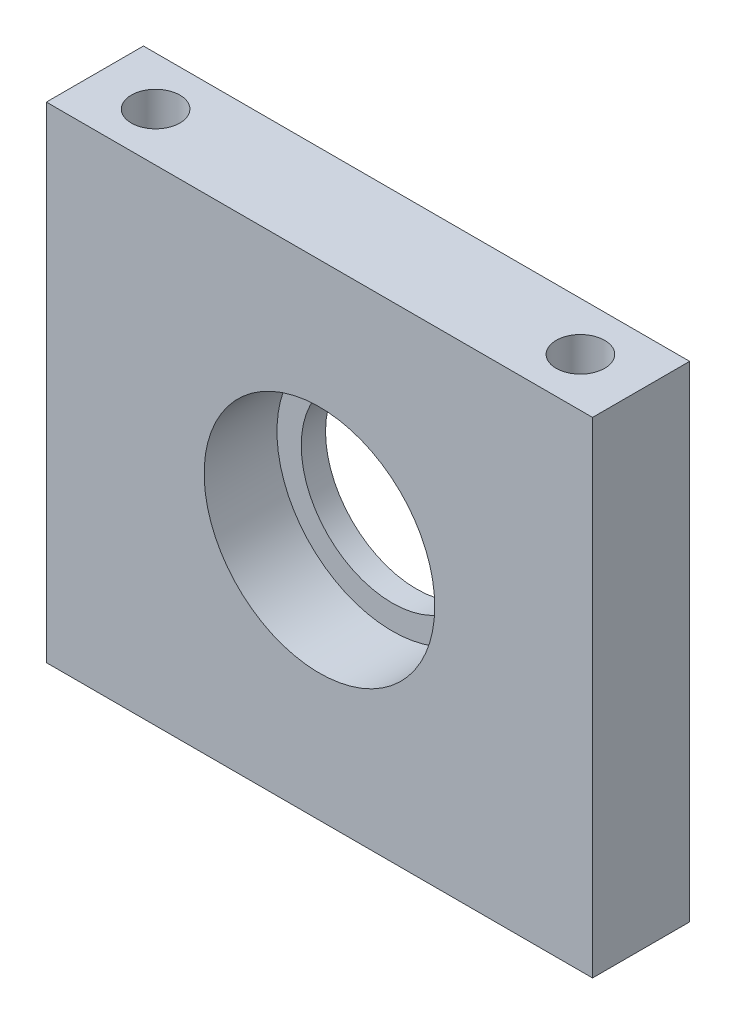
ISO-10303-21;
HEADER;
FILE_DESCRIPTION(('STEP AP214'),'2;1');
FILE_NAME('part.step','',(''),(''),'','','');
FILE_SCHEMA(('AUTOMOTIVE_DESIGN { 1 0 10303 214 1 1 1 1 }'));
ENDSEC;
DATA;
#1=APPLICATION_CONTEXT('core data for automotive mechanical design processes');
#2=APPLICATION_PROTOCOL_DEFINITION('international standard','automotive_design',2000,#1);
#3=PRODUCT_CONTEXT('',#1,'mechanical');
#4=PRODUCT('Part','Part','',(#3));
#5=PRODUCT_RELATED_PRODUCT_CATEGORY('part','',(#4));
#6=PRODUCT_DEFINITION_FORMATION('','',#4);
#7=PRODUCT_DEFINITION_CONTEXT('part definition',#1,'design');
#8=PRODUCT_DEFINITION('design','',#6,#7);
#9=PRODUCT_DEFINITION_SHAPE('','',#8);
#10=(LENGTH_UNIT() NAMED_UNIT(*) SI_UNIT(.MILLI.,.METRE.));
#11=(NAMED_UNIT(*) PLANE_ANGLE_UNIT() SI_UNIT($,.RADIAN.));
#12=(NAMED_UNIT(*) SI_UNIT($,.STERADIAN.) SOLID_ANGLE_UNIT());
#13=UNCERTAINTY_MEASURE_WITH_UNIT(LENGTH_MEASURE(1.E-05),#10,'distance_accuracy_value','');
#14=(GEOMETRIC_REPRESENTATION_CONTEXT(3) GLOBAL_UNCERTAINTY_ASSIGNED_CONTEXT((#13)) GLOBAL_UNIT_ASSIGNED_CONTEXT((#10,
#11,#12)) REPRESENTATION_CONTEXT('',''));
#15=CARTESIAN_POINT('',(0.,0.,0.));
#16=DIRECTION('',(0.,0.,1.));
#17=DIRECTION('',(1.,0.,0.));
#18=AXIS2_PLACEMENT_3D('',#15,#16,#17);
#19=CARTESIAN_POINT('',(0.,0.,0.));
#20=DIRECTION('',(0.,0.,1.));
#21=DIRECTION('',(1.,0.,0.));
#22=AXIS2_PLACEMENT_3D('',#19,#20,#21);
#23=CYLINDRICAL_SURFACE('',#22,7.5);
#24=CARTESIAN_POINT('',(0.,0.,0.));
#25=DIRECTION('',(0.,0.,1.));
#26=DIRECTION('',(1.,0.,0.));
#27=AXIS2_PLACEMENT_3D('',#24,#25,#26);
#28=CIRCLE('',#27,7.5);
#29=CARTESIAN_POINT('',(7.5,0.,0.));
#30=VERTEX_POINT('',#29);
#31=EDGE_CURVE('E101',#30,#30,#28,.T.);
#32=ORIENTED_EDGE('',*,*,#31,.F.);
#33=EDGE_LOOP('',(#32));
#34=FACE_BOUND('',#33,.T.);
#35=CARTESIAN_POINT('',(0.,0.,2.));
#36=DIRECTION('',(0.,0.,1.));
#37=DIRECTION('',(1.,0.,0.));
#38=AXIS2_PLACEMENT_3D('',#35,#36,#37);
#39=CIRCLE('',#38,7.5);
#40=CARTESIAN_POINT('',(7.5,0.,2.));
#41=VERTEX_POINT('',#40);
#42=EDGE_CURVE('E36',#41,#41,#39,.F.);
#43=ORIENTED_EDGE('',*,*,#42,.F.);
#44=EDGE_LOOP('',(#43));
#45=FACE_BOUND('',#44,.T.);
#46=ADVANCED_FACE('F32',(#34,#45),#23,.F.);
#47=CARTESIAN_POINT('',(22.5,-20.,8.));
#48=DIRECTION('',(-1.,0.,0.));
#49=DIRECTION('',(0.,0.,1.));
#50=AXIS2_PLACEMENT_3D('',#47,#48,#49);
#51=PLANE('',#50);
#52=DIRECTION('',(0.,1.,0.));
#53=VECTOR('',#52,1.);
#54=CARTESIAN_POINT('',(22.5,-20.,0.));
#55=LINE('',#54,#53);
#56=CARTESIAN_POINT('',(22.5,-20.,0.));
#57=VERTEX_POINT('',#56);
#58=CARTESIAN_POINT('',(22.5,20.,0.));
#59=VERTEX_POINT('',#58);
#60=EDGE_CURVE('E98',#57,#59,#55,.T.);
#61=ORIENTED_EDGE('',*,*,#60,.T.);
#62=DIRECTION('',(0.,0.,-1.));
#63=VECTOR('',#62,1.);
#64=CARTESIAN_POINT('',(22.5,20.,8.));
#65=LINE('',#64,#63);
#66=CARTESIAN_POINT('',(22.5,20.,8.));
#67=VERTEX_POINT('',#66);
#68=EDGE_CURVE('E11',#67,#59,#65,.T.);
#69=ORIENTED_EDGE('',*,*,#68,.F.);
#70=DIRECTION('',(0.,1.,0.));
#71=VECTOR('',#70,1.);
#72=CARTESIAN_POINT('',(22.5,-20.,8.));
#73=LINE('',#72,#71);
#74=CARTESIAN_POINT('',(22.5,-20.,8.));
#75=VERTEX_POINT('',#74);
#76=EDGE_CURVE('E85',#75,#67,#73,.T.);
#77=ORIENTED_EDGE('',*,*,#76,.F.);
#78=DIRECTION('',(0.,0.,-1.));
#79=VECTOR('',#78,1.);
#80=CARTESIAN_POINT('',(22.5,-20.,8.));
#81=LINE('',#80,#79);
#82=EDGE_CURVE('E94',#75,#57,#81,.T.);
#83=ORIENTED_EDGE('',*,*,#82,.T.);
#84=EDGE_LOOP('',(#61,#69,#77,#83));
#85=FACE_BOUND('',#84,.T.);
#86=ADVANCED_FACE('F34',(#85),#51,.F.);
#87=CARTESIAN_POINT('',(-22.5,20.,8.));
#88=DIRECTION('',(0.,-1.,0.));
#89=DIRECTION('',(0.,0.,-1.));
#90=AXIS2_PLACEMENT_3D('',#87,#88,#89);
#91=PLANE('',#90);
#92=CARTESIAN_POINT('',(-17.5,20.,4.));
#93=DIRECTION('',(0.,1.,0.));
#94=DIRECTION('',(0.,0.,1.));
#95=AXIS2_PLACEMENT_3D('',#92,#93,#94);
#96=CIRCLE('',#95,2.);
#97=CARTESIAN_POINT('',(-17.5,20.,6.));
#98=VERTEX_POINT('',#97);
#99=EDGE_CURVE('E127',#98,#98,#96,.T.);
#100=ORIENTED_EDGE('',*,*,#99,.F.);
#101=EDGE_LOOP('',(#100));
#102=FACE_BOUND('',#101,.T.);
#103=CARTESIAN_POINT('',(17.5,20.,4.));
#104=DIRECTION('',(0.,1.,0.));
#105=DIRECTION('',(0.,0.,1.));
#106=AXIS2_PLACEMENT_3D('',#103,#104,#105);
#107=CIRCLE('',#106,2.);
#108=CARTESIAN_POINT('',(17.5,20.,6.));
#109=VERTEX_POINT('',#108);
#110=EDGE_CURVE('E121',#109,#109,#107,.T.);
#111=ORIENTED_EDGE('',*,*,#110,.F.);
#112=EDGE_LOOP('',(#111));
#113=FACE_BOUND('',#112,.T.);
#114=DIRECTION('',(-1.,0.,0.));
#115=VECTOR('',#114,1.);
#116=CARTESIAN_POINT('',(-22.5,20.,0.));
#117=LINE('',#116,#115);
#118=CARTESIAN_POINT('',(-22.5,20.,0.));
#119=VERTEX_POINT('',#118);
#120=EDGE_CURVE('E89',#59,#119,#117,.T.);
#121=ORIENTED_EDGE('',*,*,#120,.T.);
#122=DIRECTION('',(0.,0.,-1.));
#123=VECTOR('',#122,1.);
#124=CARTESIAN_POINT('',(-22.5,20.,8.));
#125=LINE('',#124,#123);
#126=CARTESIAN_POINT('',(-22.5,20.,8.));
#127=VERTEX_POINT('',#126);
#128=EDGE_CURVE('E42',#127,#119,#125,.T.);
#129=ORIENTED_EDGE('',*,*,#128,.F.);
#130=DIRECTION('',(-1.,0.,0.));
#131=VECTOR('',#130,1.);
#132=CARTESIAN_POINT('',(-22.5,20.,8.));
#133=LINE('',#132,#131);
#134=EDGE_CURVE('E80',#67,#127,#133,.T.);
#135=ORIENTED_EDGE('',*,*,#134,.F.);
#136=ORIENTED_EDGE('',*,*,#68,.T.);
#137=EDGE_LOOP('',(#121,#129,#135,#136));
#138=FACE_BOUND('',#137,.T.);
#139=ADVANCED_FACE('F88',(#102,#113,#138),#91,.F.);
#140=CARTESIAN_POINT('',(-22.5,-20.,8.));
#141=DIRECTION('',(1.,0.,0.));
#142=DIRECTION('',(0.,0.,-1.));
#143=AXIS2_PLACEMENT_3D('',#140,#141,#142);
#144=PLANE('',#143);
#145=DIRECTION('',(0.,-1.,0.));
#146=VECTOR('',#145,1.);
#147=CARTESIAN_POINT('',(-22.5,-20.,0.));
#148=LINE('',#147,#146);
#149=CARTESIAN_POINT('',(-22.5,-20.,0.));
#150=VERTEX_POINT('',#149);
#151=EDGE_CURVE('E67',#119,#150,#148,.T.);
#152=ORIENTED_EDGE('',*,*,#151,.T.);
#153=DIRECTION('',(0.,0.,-1.));
#154=VECTOR('',#153,1.);
#155=CARTESIAN_POINT('',(-22.5,-20.,8.));
#156=LINE('',#155,#154);
#157=CARTESIAN_POINT('',(-22.5,-20.,8.));
#158=VERTEX_POINT('',#157);
#159=EDGE_CURVE('E90',#158,#150,#156,.T.);
#160=ORIENTED_EDGE('',*,*,#159,.F.);
#161=DIRECTION('',(0.,-1.,0.));
#162=VECTOR('',#161,1.);
#163=CARTESIAN_POINT('',(-22.5,-20.,8.));
#164=LINE('',#163,#162);
#165=EDGE_CURVE('E83',#127,#158,#164,.T.);
#166=ORIENTED_EDGE('',*,*,#165,.F.);
#167=ORIENTED_EDGE('',*,*,#128,.T.);
#168=EDGE_LOOP('',(#152,#160,#166,#167));
#169=FACE_BOUND('',#168,.T.);
#170=ADVANCED_FACE('F92',(#169),#144,.F.);
#171=CARTESIAN_POINT('',(-22.5,-20.,8.));
#172=DIRECTION('',(0.,1.,0.));
#173=DIRECTION('',(0.,0.,1.));
#174=AXIS2_PLACEMENT_3D('',#171,#172,#173);
#175=PLANE('',#174);
#176=CARTESIAN_POINT('',(-17.5,-20.,4.));
#177=DIRECTION('',(0.,1.,0.));
#178=DIRECTION('',(0.,0.,1.));
#179=AXIS2_PLACEMENT_3D('',#176,#177,#178);
#180=CIRCLE('',#179,2.);
#181=CARTESIAN_POINT('',(-17.5,-20.,6.));
#182=VERTEX_POINT('',#181);
#183=EDGE_CURVE('E118',#182,#182,#180,.T.);
#184=ORIENTED_EDGE('',*,*,#183,.T.);
#185=EDGE_LOOP('',(#184));
#186=FACE_BOUND('',#185,.T.);
#187=CARTESIAN_POINT('',(17.5,-20.,4.));
#188=DIRECTION('',(0.,1.,0.));
#189=DIRECTION('',(0.,0.,1.));
#190=AXIS2_PLACEMENT_3D('',#187,#188,#189);
#191=CIRCLE('',#190,2.);
#192=CARTESIAN_POINT('',(17.5,-20.,6.));
#193=VERTEX_POINT('',#192);
#194=EDGE_CURVE('E124',#193,#193,#191,.T.);
#195=ORIENTED_EDGE('',*,*,#194,.T.);
#196=EDGE_LOOP('',(#195));
#197=FACE_BOUND('',#196,.T.);
#198=DIRECTION('',(1.,0.,0.));
#199=VECTOR('',#198,1.);
#200=CARTESIAN_POINT('',(-22.5,-20.,0.));
#201=LINE('',#200,#199);
#202=EDGE_CURVE('E73',#150,#57,#201,.T.);
#203=ORIENTED_EDGE('',*,*,#202,.T.);
#204=ORIENTED_EDGE('',*,*,#82,.F.);
#205=DIRECTION('',(1.,0.,0.));
#206=VECTOR('',#205,1.);
#207=CARTESIAN_POINT('',(-22.5,-20.,8.));
#208=LINE('',#207,#206);
#209=EDGE_CURVE('E50',#158,#75,#208,.T.);
#210=ORIENTED_EDGE('',*,*,#209,.F.);
#211=ORIENTED_EDGE('',*,*,#159,.T.);
#212=EDGE_LOOP('',(#203,#204,#210,#211));
#213=FACE_BOUND('',#212,.T.);
#214=ADVANCED_FACE('F106',(#186,#197,#213),#175,.F.);
#215=CARTESIAN_POINT('',(0.,0.,8.));
#216=DIRECTION('',(0.,0.,-1.));
#217=DIRECTION('',(-1.,0.,0.));
#218=AXIS2_PLACEMENT_3D('',#215,#216,#217);
#219=PLANE('',#218);
#220=CARTESIAN_POINT('',(0.,0.,8.));
#221=DIRECTION('',(0.,0.,1.));
#222=DIRECTION('',(1.,0.,0.));
#223=AXIS2_PLACEMENT_3D('',#220,#221,#222);
#224=CIRCLE('',#223,9.5);
#225=CARTESIAN_POINT('',(9.5,0.,8.));
#226=VERTEX_POINT('',#225);
#227=EDGE_CURVE('E114',#226,#226,#224,.T.);
#228=ORIENTED_EDGE('',*,*,#227,.F.);
#229=EDGE_LOOP('',(#228));
#230=FACE_BOUND('',#229,.T.);
#231=ORIENTED_EDGE('',*,*,#76,.T.);
#232=ORIENTED_EDGE('',*,*,#134,.T.);
#233=ORIENTED_EDGE('',*,*,#165,.T.);
#234=ORIENTED_EDGE('',*,*,#209,.T.);
#235=EDGE_LOOP('',(#231,#232,#233,#234));
#236=FACE_BOUND('',#235,.T.);
#237=ADVANCED_FACE('F81',(#230,#236),#219,.F.);
#238=CARTESIAN_POINT('',(0.,0.,0.));
#239=DIRECTION('',(0.,0.,-1.));
#240=DIRECTION('',(-1.,0.,0.));
#241=AXIS2_PLACEMENT_3D('',#238,#239,#240);
#242=PLANE('',#241);
#243=ORIENTED_EDGE('',*,*,#31,.T.);
#244=EDGE_LOOP('',(#243));
#245=FACE_BOUND('',#244,.T.);
#246=ORIENTED_EDGE('',*,*,#60,.F.);
#247=ORIENTED_EDGE('',*,*,#202,.F.);
#248=ORIENTED_EDGE('',*,*,#151,.F.);
#249=ORIENTED_EDGE('',*,*,#120,.F.);
#250=EDGE_LOOP('',(#246,#247,#248,#249));
#251=FACE_BOUND('',#250,.T.);
#252=ADVANCED_FACE('F109',(#245,#251),#242,.T.);
#253=CARTESIAN_POINT('',(0.,0.,2.));
#254=DIRECTION('',(0.,0.,1.));
#255=DIRECTION('',(1.,0.,0.));
#256=AXIS2_PLACEMENT_3D('',#253,#254,#255);
#257=PLANE('',#256);
#258=CARTESIAN_POINT('',(0.,0.,2.));
#259=DIRECTION('',(0.,0.,1.));
#260=DIRECTION('',(1.,0.,0.));
#261=AXIS2_PLACEMENT_3D('',#258,#259,#260);
#262=CIRCLE('',#261,9.5);
#263=CARTESIAN_POINT('',(9.5,0.,2.));
#264=VERTEX_POINT('',#263);
#265=EDGE_CURVE('E117',#264,#264,#262,.T.);
#266=ORIENTED_EDGE('',*,*,#265,.T.);
#267=EDGE_LOOP('',(#266));
#268=FACE_BOUND('',#267,.T.);
#269=ORIENTED_EDGE('',*,*,#42,.T.);
#270=EDGE_LOOP('',(#269));
#271=FACE_BOUND('',#270,.T.);
#272=ADVANCED_FACE('F153',(#268,#271),#257,.T.);
#273=CARTESIAN_POINT('',(0.,0.,2.));
#274=DIRECTION('',(0.,0.,1.));
#275=DIRECTION('',(1.,0.,0.));
#276=AXIS2_PLACEMENT_3D('',#273,#274,#275);
#277=CYLINDRICAL_SURFACE('',#276,9.5);
#278=ORIENTED_EDGE('',*,*,#265,.F.);
#279=EDGE_LOOP('',(#278));
#280=FACE_BOUND('',#279,.T.);
#281=ORIENTED_EDGE('',*,*,#227,.T.);
#282=EDGE_LOOP('',(#281));
#283=FACE_BOUND('',#282,.T.);
#284=ADVANCED_FACE('F147',(#280,#283),#277,.F.);
#285=CARTESIAN_POINT('',(17.5,-20.,4.));
#286=DIRECTION('',(0.,1.,0.));
#287=DIRECTION('',(0.,0.,1.));
#288=AXIS2_PLACEMENT_3D('',#285,#286,#287);
#289=CYLINDRICAL_SURFACE('',#288,2.);
#290=ORIENTED_EDGE('',*,*,#194,.F.);
#291=EDGE_LOOP('',(#290));
#292=FACE_BOUND('',#291,.T.);
#293=ORIENTED_EDGE('',*,*,#110,.T.);
#294=EDGE_LOOP('',(#293));
#295=FACE_BOUND('',#294,.T.);
#296=ADVANCED_FACE('F138',(#292,#295),#289,.F.);
#297=CARTESIAN_POINT('',(-17.5,-20.,4.));
#298=DIRECTION('',(0.,1.,0.));
#299=DIRECTION('',(0.,0.,1.));
#300=AXIS2_PLACEMENT_3D('',#297,#298,#299);
#301=CYLINDRICAL_SURFACE('',#300,2.);
#302=ORIENTED_EDGE('',*,*,#183,.F.);
#303=EDGE_LOOP('',(#302));
#304=FACE_BOUND('',#303,.T.);
#305=ORIENTED_EDGE('',*,*,#99,.T.);
#306=EDGE_LOOP('',(#305));
#307=FACE_BOUND('',#306,.T.);
#308=ADVANCED_FACE('F135',(#304,#307),#301,.F.);
#309=CLOSED_SHELL('',(#46,#86,#139,#170,#214,#237,#252,#272,#284,#296,#308));
#310=MANIFOLD_SOLID_BREP('B2',#309);
#311=ADVANCED_BREP_SHAPE_REPRESENTATION('',(#18,#310),#14);
#312=SHAPE_DEFINITION_REPRESENTATION(#9,#311);
ENDSEC;
END-ISO-10303-21;
